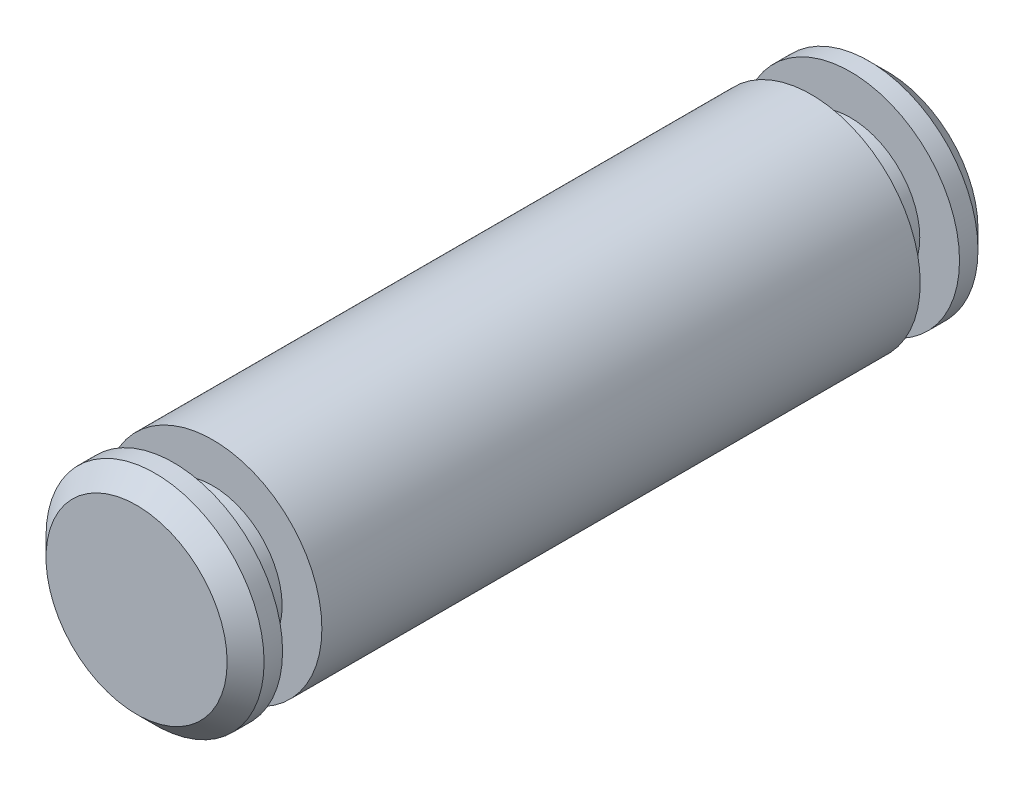
ISO-10303-21;
HEADER;
FILE_DESCRIPTION(('STEP AP214'),'2;1');
FILE_NAME('part.step','',(''),(''),'','','');
FILE_SCHEMA(('AUTOMOTIVE_DESIGN { 1 0 10303 214 1 1 1 1 }'));
ENDSEC;
DATA;
#1=APPLICATION_CONTEXT('core data for automotive mechanical design processes');
#2=APPLICATION_PROTOCOL_DEFINITION('international standard','automotive_design',2000,#1);
#3=PRODUCT_CONTEXT('',#1,'mechanical');
#4=PRODUCT('Part','Part','',(#3));
#5=PRODUCT_RELATED_PRODUCT_CATEGORY('part','',(#4));
#6=PRODUCT_DEFINITION_FORMATION('','',#4);
#7=PRODUCT_DEFINITION_CONTEXT('part definition',#1,'design');
#8=PRODUCT_DEFINITION('design','',#6,#7);
#9=PRODUCT_DEFINITION_SHAPE('','',#8);
#10=(LENGTH_UNIT() NAMED_UNIT(*) SI_UNIT(.MILLI.,.METRE.));
#11=(NAMED_UNIT(*) PLANE_ANGLE_UNIT() SI_UNIT($,.RADIAN.));
#12=(NAMED_UNIT(*) SI_UNIT($,.STERADIAN.) SOLID_ANGLE_UNIT());
#13=UNCERTAINTY_MEASURE_WITH_UNIT(LENGTH_MEASURE(1.E-05),#10,'distance_accuracy_value','');
#14=(GEOMETRIC_REPRESENTATION_CONTEXT(3) GLOBAL_UNCERTAINTY_ASSIGNED_CONTEXT((#13)) GLOBAL_UNIT_ASSIGNED_CONTEXT((#10,
#11,#12)) REPRESENTATION_CONTEXT('',''));
#15=CARTESIAN_POINT('',(0.,0.,0.));
#16=DIRECTION('',(0.,0.,1.));
#17=DIRECTION('',(1.,0.,0.));
#18=AXIS2_PLACEMENT_3D('',#15,#16,#17);
#19=CARTESIAN_POINT('',(1.38777878078145E-13,0.,5.15937499999999));
#20=DIRECTION('',(0.,0.,-1.));
#21=DIRECTION('',(-1.,0.,0.));
#22=AXIS2_PLACEMENT_3D('',#19,#20,#21);
#23=CYLINDRICAL_SURFACE('',#22,1.4986);
#24=CARTESIAN_POINT('',(2.22044604925031E-13,0.,-4.11137499999988));
#25=DIRECTION('',(0.,0.,1.));
#26=DIRECTION('',(1.,0.,0.));
#27=AXIS2_PLACEMENT_3D('',#24,#25,#26);
#28=CIRCLE('',#27,1.4986);
#29=CARTESIAN_POINT('',(1.49860000000022,0.,-4.11137499999988));
#30=VERTEX_POINT('',#29);
#31=EDGE_CURVE('E74',#30,#30,#28,.T.);
#32=ORIENTED_EDGE('',*,*,#31,.T.);
#33=EDGE_LOOP('',(#32));
#34=FACE_BOUND('',#33,.T.);
#35=CARTESIAN_POINT('',(4.71844785465692E-13,0.,4.111375));
#36=DIRECTION('',(0.,0.,1.));
#37=DIRECTION('',(1.,0.,0.));
#38=AXIS2_PLACEMENT_3D('',#35,#36,#37);
#39=CIRCLE('',#38,1.4986);
#40=CARTESIAN_POINT('',(1.49860000000047,0.,4.111375));
#41=VERTEX_POINT('',#40);
#42=EDGE_CURVE('E66',#41,#41,#39,.T.);
#43=ORIENTED_EDGE('',*,*,#42,.F.);
#44=EDGE_LOOP('',(#43));
#45=FACE_BOUND('',#44,.T.);
#46=ADVANCED_FACE('F32',(#34,#45),#23,.T.);
#47=CARTESIAN_POINT('',(1.38777878078145E-13,0.,4.905375));
#48=DIRECTION('',(0.,0.,1.));
#49=DIRECTION('',(1.,0.,0.));
#50=AXIS2_PLACEMENT_3D('',#47,#48,#49);
#51=CIRCLE('',#50,1.4986);
#52=CARTESIAN_POINT('',(1.49860000000014,0.,4.905375));
#53=VERTEX_POINT('',#52);
#54=EDGE_CURVE('E10',#53,#53,#51,.F.);
#55=ORIENTED_EDGE('',*,*,#54,.T.);
#56=EDGE_LOOP('',(#55));
#57=FACE_BOUND('',#56,.T.);
#58=CARTESIAN_POINT('',(4.9960036108132E-13,0.,4.651375));
#59=DIRECTION('',(0.,0.,1.));
#60=DIRECTION('',(1.,0.,0.));
#61=AXIS2_PLACEMENT_3D('',#58,#59,#60);
#62=CIRCLE('',#61,1.4986);
#63=CARTESIAN_POINT('',(1.4986000000005,0.,4.651375));
#64=VERTEX_POINT('',#63);
#65=EDGE_CURVE('E70',#64,#64,#62,.T.);
#66=ORIENTED_EDGE('',*,*,#65,.T.);
#67=EDGE_LOOP('',(#66));
#68=FACE_BOUND('',#67,.T.);
#69=ADVANCED_FACE('F100',(#57,#68),#23,.T.);
#70=CARTESIAN_POINT('',(1.38777878078145E-13,0.,5.15937499999999));
#71=DIRECTION('',(0.,0.,1.));
#72=DIRECTION('',(1.,0.,0.));
#73=AXIS2_PLACEMENT_3D('',#70,#71,#72);
#74=PLANE('',#73);
#75=CARTESIAN_POINT('',(1.38777878078145E-13,0.,5.15937499999999));
#76=DIRECTION('',(0.,0.,1.));
#77=DIRECTION('',(1.,0.,0.));
#78=AXIS2_PLACEMENT_3D('',#75,#76,#77);
#79=CIRCLE('',#78,1.2446);
#80=CARTESIAN_POINT('',(1.24460000000014,0.,5.15937499999999));
#81=VERTEX_POINT('',#80);
#82=EDGE_CURVE('E40',#81,#81,#79,.T.);
#83=ORIENTED_EDGE('',*,*,#82,.T.);
#84=EDGE_LOOP('',(#83));
#85=FACE_BOUND('',#84,.T.);
#86=ADVANCED_FACE('F111',(#85),#74,.T.);
#87=CARTESIAN_POINT('',(4.44089209850063E-13,-1.49859999999992,4.651375));
#88=DIRECTION('',(0.,0.,1.));
#89=DIRECTION('',(1.,0.,0.));
#90=AXIS2_PLACEMENT_3D('',#87,#88,#89);
#91=PLANE('',#90);
#92=ORIENTED_EDGE('',*,*,#65,.F.);
#93=EDGE_LOOP('',(#92));
#94=FACE_BOUND('',#93,.T.);
#95=CARTESIAN_POINT('',(4.9960036108132E-13,0.,4.651375));
#96=DIRECTION('',(0.,0.,1.));
#97=DIRECTION('',(1.,0.,0.));
#98=AXIS2_PLACEMENT_3D('',#95,#96,#97);
#99=CIRCLE('',#98,0.9525);
#100=CARTESIAN_POINT('',(0.9525000000005,0.,4.651375));
#101=VERTEX_POINT('',#100);
#102=EDGE_CURVE('E58',#101,#101,#99,.T.);
#103=ORIENTED_EDGE('',*,*,#102,.T.);
#104=EDGE_LOOP('',(#103));
#105=FACE_BOUND('',#104,.T.);
#106=ADVANCED_FACE('F115',(#94,#105),#91,.F.);
#107=CARTESIAN_POINT('',(0.,0.,8.82803245544554));
#108=DIRECTION('',(0.,0.,1.));
#109=DIRECTION('',(1.,0.,0.));
#110=AXIS2_PLACEMENT_3D('',#107,#108,#109);
#111=CYLINDRICAL_SURFACE('',#110,0.9525);
#112=ORIENTED_EDGE('',*,*,#102,.F.);
#113=EDGE_LOOP('',(#112));
#114=FACE_BOUND('',#113,.T.);
#115=CARTESIAN_POINT('',(4.71844785465692E-13,0.,4.111375));
#116=DIRECTION('',(0.,0.,1.));
#117=DIRECTION('',(1.,0.,0.));
#118=AXIS2_PLACEMENT_3D('',#115,#116,#117);
#119=CIRCLE('',#118,0.9525);
#120=CARTESIAN_POINT('',(0.952500000000472,0.,4.111375));
#121=VERTEX_POINT('',#120);
#122=EDGE_CURVE('E62',#121,#121,#119,.T.);
#123=ORIENTED_EDGE('',*,*,#122,.T.);
#124=EDGE_LOOP('',(#123));
#125=FACE_BOUND('',#124,.T.);
#126=ADVANCED_FACE('F122',(#114,#125),#111,.T.);
#127=CARTESIAN_POINT('',(1.66533453693773E-13,-1.49859999999996,4.111375));
#128=DIRECTION('',(0.,0.,-1.));
#129=DIRECTION('',(-1.,0.,0.));
#130=AXIS2_PLACEMENT_3D('',#127,#128,#129);
#131=PLANE('',#130);
#132=ORIENTED_EDGE('',*,*,#122,.F.);
#133=EDGE_LOOP('',(#132));
#134=FACE_BOUND('',#133,.T.);
#135=ORIENTED_EDGE('',*,*,#42,.T.);
#136=EDGE_LOOP('',(#135));
#137=FACE_BOUND('',#136,.T.);
#138=ADVANCED_FACE('F128',(#134,#137),#131,.F.);
#139=CARTESIAN_POINT('',(1.94289029309402E-13,-1.4986,-4.11137499999988));
#140=DIRECTION('',(0.,0.,1.));
#141=DIRECTION('',(1.,0.,0.));
#142=AXIS2_PLACEMENT_3D('',#139,#140,#141);
#143=PLANE('',#142);
#144=ORIENTED_EDGE('',*,*,#31,.F.);
#145=EDGE_LOOP('',(#144));
#146=FACE_BOUND('',#145,.T.);
#147=CARTESIAN_POINT('',(2.22044604925031E-13,0.,-4.11137499999988));
#148=DIRECTION('',(0.,0.,1.));
#149=DIRECTION('',(1.,0.,0.));
#150=AXIS2_PLACEMENT_3D('',#147,#148,#149);
#151=CIRCLE('',#150,0.952499999999999);
#152=CARTESIAN_POINT('',(0.952500000000222,0.,-4.11137499999988));
#153=VERTEX_POINT('',#152);
#154=EDGE_CURVE('E78',#153,#153,#151,.T.);
#155=ORIENTED_EDGE('',*,*,#154,.T.);
#156=EDGE_LOOP('',(#155));
#157=FACE_BOUND('',#156,.T.);
#158=ADVANCED_FACE('F134',(#146,#157),#143,.F.);
#159=CARTESIAN_POINT('',(0.,0.,8.82803245544554));
#160=DIRECTION('',(0.,0.,1.));
#161=DIRECTION('',(1.,0.,0.));
#162=AXIS2_PLACEMENT_3D('',#159,#160,#161);
#163=CYLINDRICAL_SURFACE('',#162,0.952499999999999);
#164=ORIENTED_EDGE('',*,*,#154,.F.);
#165=EDGE_LOOP('',(#164));
#166=FACE_BOUND('',#165,.T.);
#167=CARTESIAN_POINT('',(1.11022302462516E-13,0.,-4.65137499999988));
#168=DIRECTION('',(0.,0.,1.));
#169=DIRECTION('',(1.,0.,0.));
#170=AXIS2_PLACEMENT_3D('',#167,#168,#169);
#171=CIRCLE('',#170,0.952499999999999);
#172=CARTESIAN_POINT('',(0.95250000000011,0.,-4.65137499999988));
#173=VERTEX_POINT('',#172);
#174=EDGE_CURVE('E82',#173,#173,#171,.T.);
#175=ORIENTED_EDGE('',*,*,#174,.T.);
#176=EDGE_LOOP('',(#175));
#177=FACE_BOUND('',#176,.T.);
#178=ADVANCED_FACE('F141',(#166,#177),#163,.T.);
#179=CARTESIAN_POINT('',(0.,-1.49859999999996,-4.65137499999988));
#180=DIRECTION('',(0.,0.,-1.));
#181=DIRECTION('',(-1.,0.,0.));
#182=AXIS2_PLACEMENT_3D('',#179,#180,#181);
#183=PLANE('',#182);
#184=ORIENTED_EDGE('',*,*,#174,.F.);
#185=EDGE_LOOP('',(#184));
#186=FACE_BOUND('',#185,.T.);
#187=CARTESIAN_POINT('',(1.11022302462516E-13,0.,-4.65137499999988));
#188=DIRECTION('',(0.,0.,1.));
#189=DIRECTION('',(1.,0.,0.));
#190=AXIS2_PLACEMENT_3D('',#187,#188,#189);
#191=CIRCLE('',#190,1.4986);
#192=CARTESIAN_POINT('',(1.49860000000011,0.,-4.65137499999988));
#193=VERTEX_POINT('',#192);
#194=EDGE_CURVE('E86',#193,#193,#191,.T.);
#195=ORIENTED_EDGE('',*,*,#194,.T.);
#196=EDGE_LOOP('',(#195));
#197=FACE_BOUND('',#196,.T.);
#198=ADVANCED_FACE('F92',(#186,#197),#183,.F.);
#199=CARTESIAN_POINT('',(0.,0.,-5.15937499999988));
#200=DIRECTION('',(0.,0.,1.));
#201=DIRECTION('',(1.,0.,0.));
#202=AXIS2_PLACEMENT_3D('',#199,#200,#201);
#203=PLANE('',#202);
#204=CARTESIAN_POINT('',(0.,0.,-5.15937499999988));
#205=DIRECTION('',(0.,0.,1.));
#206=DIRECTION('',(1.,0.,0.));
#207=AXIS2_PLACEMENT_3D('',#204,#205,#206);
#208=CIRCLE('',#207,1.2446);
#209=CARTESIAN_POINT('',(1.2446,0.,-5.15937499999988));
#210=VERTEX_POINT('',#209);
#211=EDGE_CURVE('E46',#210,#210,#208,.F.);
#212=ORIENTED_EDGE('',*,*,#211,.T.);
#213=EDGE_LOOP('',(#212));
#214=FACE_BOUND('',#213,.T.);
#215=ADVANCED_FACE('F97',(#214),#203,.F.);
#216=CARTESIAN_POINT('',(0.,0.,-4.90537499999989));
#217=DIRECTION('',(0.,0.,1.));
#218=DIRECTION('',(1.,0.,0.));
#219=AXIS2_PLACEMENT_3D('',#216,#217,#218);
#220=CIRCLE('',#219,1.4986);
#221=CARTESIAN_POINT('',(1.4986,0.,-4.90537499999989));
#222=VERTEX_POINT('',#221);
#223=EDGE_CURVE('E52',#222,#222,#220,.T.);
#224=ORIENTED_EDGE('',*,*,#223,.T.);
#225=EDGE_LOOP('',(#224));
#226=FACE_BOUND('',#225,.T.);
#227=ORIENTED_EDGE('',*,*,#194,.F.);
#228=EDGE_LOOP('',(#227));
#229=FACE_BOUND('',#228,.T.);
#230=ADVANCED_FACE('F94',(#226,#229),#23,.T.);
#231=CARTESIAN_POINT('',(0.,0.,-4.90537499999989));
#232=DIRECTION('',(0.,0.,1.));
#233=DIRECTION('',(1.,0.,0.));
#234=AXIS2_PLACEMENT_3D('',#231,#232,#233);
#235=CONICAL_SURFACE('',#234,1.4986,0.785398163397448);
#236=ORIENTED_EDGE('',*,*,#211,.F.);
#237=EDGE_LOOP('',(#236));
#238=FACE_BOUND('',#237,.T.);
#239=ORIENTED_EDGE('',*,*,#223,.F.);
#240=EDGE_LOOP('',(#239));
#241=FACE_BOUND('',#240,.T.);
#242=ADVANCED_FACE('F96',(#238,#241),#235,.T.);
#243=CARTESIAN_POINT('',(1.38777878078145E-13,0.,5.15937499999999));
#244=DIRECTION('',(0.,0.,-1.));
#245=DIRECTION('',(-1.,0.,0.));
#246=AXIS2_PLACEMENT_3D('',#243,#244,#245);
#247=CONICAL_SURFACE('',#246,1.2446,0.785398163397448);
#248=ORIENTED_EDGE('',*,*,#54,.F.);
#249=EDGE_LOOP('',(#248));
#250=FACE_BOUND('',#249,.T.);
#251=ORIENTED_EDGE('',*,*,#82,.F.);
#252=EDGE_LOOP('',(#251));
#253=FACE_BOUND('',#252,.T.);
#254=ADVANCED_FACE('F34',(#250,#253),#247,.T.);
#255=CLOSED_SHELL('',(#46,#69,#86,#106,#126,#138,#158,#178,#198,#215,#230,#242,#254));
#256=MANIFOLD_SOLID_BREP('B2',#255);
#257=ADVANCED_BREP_SHAPE_REPRESENTATION('',(#18,#256),#14);
#258=SHAPE_DEFINITION_REPRESENTATION(#9,#257);
ENDSEC;
END-ISO-10303-21;
